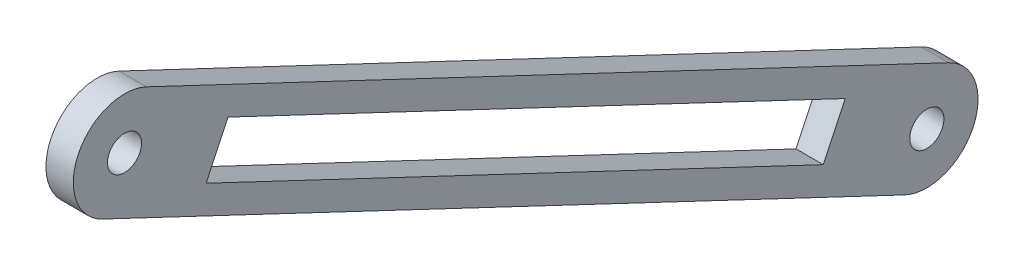
ISO-10303-21;
HEADER;
FILE_DESCRIPTION(('STEP AP214'),'2;1');
FILE_NAME('part.step','',(''),(''),'','','');
FILE_SCHEMA(('AUTOMOTIVE_DESIGN { 1 0 10303 214 1 1 1 1 }'));
ENDSEC;
DATA;
#1=APPLICATION_CONTEXT('core data for automotive mechanical design processes');
#2=APPLICATION_PROTOCOL_DEFINITION('international standard','automotive_design',2000,#1);
#3=PRODUCT_CONTEXT('',#1,'mechanical');
#4=PRODUCT('Part','Part','',(#3));
#5=PRODUCT_RELATED_PRODUCT_CATEGORY('part','',(#4));
#6=PRODUCT_DEFINITION_FORMATION('','',#4);
#7=PRODUCT_DEFINITION_CONTEXT('part definition',#1,'design');
#8=PRODUCT_DEFINITION('design','',#6,#7);
#9=PRODUCT_DEFINITION_SHAPE('','',#8);
#10=(LENGTH_UNIT() NAMED_UNIT(*) SI_UNIT(.MILLI.,.METRE.));
#11=(NAMED_UNIT(*) PLANE_ANGLE_UNIT() SI_UNIT($,.RADIAN.));
#12=(NAMED_UNIT(*) SI_UNIT($,.STERADIAN.) SOLID_ANGLE_UNIT());
#13=UNCERTAINTY_MEASURE_WITH_UNIT(LENGTH_MEASURE(1.E-05),#10,'distance_accuracy_value','');
#14=(GEOMETRIC_REPRESENTATION_CONTEXT(3) GLOBAL_UNCERTAINTY_ASSIGNED_CONTEXT((#13)) GLOBAL_UNIT_ASSIGNED_CONTEXT((#10,
#11,#12)) REPRESENTATION_CONTEXT('',''));
#15=CARTESIAN_POINT('',(0.,0.,0.));
#16=DIRECTION('',(0.,0.,1.));
#17=DIRECTION('',(1.,0.,0.));
#18=AXIS2_PLACEMENT_3D('',#15,#16,#17);
#19=CARTESIAN_POINT('',(57.,320.133867520905,-124.521978991094));
#20=DIRECTION('',(1.,0.,0.));
#21=DIRECTION('',(0.,0.,-1.));
#22=AXIS2_PLACEMENT_3D('',#19,#20,#21);
#23=CYLINDRICAL_SURFACE('',#22,11.25);
#24=CARTESIAN_POINT('',(63.,320.133867520905,-124.521978991094));
#25=DIRECTION('',(1.,0.,0.));
#26=DIRECTION('',(0.,0.,-1.));
#27=AXIS2_PLACEMENT_3D('',#24,#25,#26);
#28=CIRCLE('',#27,11.25);
#29=CARTESIAN_POINT('',(63.,330.29992469328,-129.340047231375));
#30=VERTEX_POINT('',#29);
#31=CARTESIAN_POINT('',(63.,309.96781034853,-119.703910750813));
#32=VERTEX_POINT('',#31);
#33=EDGE_CURVE('E141',#30,#32,#28,.T.);
#34=ORIENTED_EDGE('',*,*,#33,.F.);
#35=DIRECTION('',(1.,0.,0.));
#36=VECTOR('',#35,1.);
#37=CARTESIAN_POINT('',(57.,330.29992469328,-129.340047231375));
#38=LINE('',#37,#36);
#39=CARTESIAN_POINT('',(57.,330.29992469328,-129.340047231375));
#40=VERTEX_POINT('',#39);
#41=EDGE_CURVE('E11',#40,#30,#38,.T.);
#42=ORIENTED_EDGE('',*,*,#41,.F.);
#43=CARTESIAN_POINT('',(57.,320.133867520905,-124.521978991094));
#44=DIRECTION('',(1.,0.,0.));
#45=DIRECTION('',(0.,0.,-1.));
#46=AXIS2_PLACEMENT_3D('',#43,#44,#45);
#47=CIRCLE('',#46,11.25);
#48=CARTESIAN_POINT('',(57.,309.96781034853,-119.703910750813));
#49=VERTEX_POINT('',#48);
#50=EDGE_CURVE('E144',#40,#49,#47,.T.);
#51=ORIENTED_EDGE('',*,*,#50,.T.);
#52=DIRECTION('',(1.,0.,0.));
#53=VECTOR('',#52,1.);
#54=CARTESIAN_POINT('',(57.,309.96781034853,-119.703910750813));
#55=LINE('',#54,#53);
#56=EDGE_CURVE('E35',#49,#32,#55,.T.);
#57=ORIENTED_EDGE('',*,*,#56,.T.);
#58=EDGE_LOOP('',(#34,#42,#51,#57));
#59=FACE_BOUND('',#58,.T.);
#60=ADVANCED_FACE('F32',(#59),#23,.T.);
#61=CARTESIAN_POINT('',(57.,330.29992469328,-129.340047231375));
#62=DIRECTION('',(0.,0.903649526433319,-0.428272732469438));
#63=DIRECTION('',(0.,0.428272732469438,0.903649526433319));
#64=AXIS2_PLACEMENT_3D('',#61,#62,#63);
#65=PLANE('',#64);
#66=DIRECTION('',(0.,0.428272732469438,0.903649526433319));
#67=VECTOR('',#66,1.);
#68=CARTESIAN_POINT('',(63.,330.29992469328,-129.340047231375));
#69=LINE('',#68,#67);
#70=CARTESIAN_POINT('',(63.,246.786741861739,-305.551704885872));
#71=VERTEX_POINT('',#70);
#72=EDGE_CURVE('E148',#71,#30,#69,.T.);
#73=ORIENTED_EDGE('',*,*,#72,.F.);
#74=DIRECTION('',(1.,0.,0.));
#75=VECTOR('',#74,1.);
#76=CARTESIAN_POINT('',(57.,246.786741861739,-305.551704885872));
#77=LINE('',#76,#75);
#78=CARTESIAN_POINT('',(57.,246.786741861739,-305.551704885872));
#79=VERTEX_POINT('',#78);
#80=EDGE_CURVE('E40',#79,#71,#77,.T.);
#81=ORIENTED_EDGE('',*,*,#80,.F.);
#82=DIRECTION('',(0.,0.428272732469438,0.903649526433319));
#83=VECTOR('',#82,1.);
#84=CARTESIAN_POINT('',(57.,330.29992469328,-129.340047231375));
#85=LINE('',#84,#83);
#86=EDGE_CURVE('E154',#79,#40,#85,.T.);
#87=ORIENTED_EDGE('',*,*,#86,.T.);
#88=ORIENTED_EDGE('',*,*,#41,.T.);
#89=EDGE_LOOP('',(#73,#81,#87,#88));
#90=FACE_BOUND('',#89,.T.);
#91=ADVANCED_FACE('F180',(#90),#65,.T.);
#92=CARTESIAN_POINT('',(57.,236.620684689364,-300.733636645591));
#93=DIRECTION('',(1.,0.,0.));
#94=DIRECTION('',(0.,0.,-1.));
#95=AXIS2_PLACEMENT_3D('',#92,#93,#94);
#96=CYLINDRICAL_SURFACE('',#95,11.25);
#97=CARTESIAN_POINT('',(63.,236.620684689364,-300.733636645591));
#98=DIRECTION('',(1.,0.,0.));
#99=DIRECTION('',(0.,0.,-1.));
#100=AXIS2_PLACEMENT_3D('',#97,#98,#99);
#101=CIRCLE('',#100,11.25);
#102=CARTESIAN_POINT('',(63.,226.45462751699,-295.91556840531));
#103=VERTEX_POINT('',#102);
#104=EDGE_CURVE('E162',#103,#71,#101,.T.);
#105=ORIENTED_EDGE('',*,*,#104,.F.);
#106=DIRECTION('',(1.,0.,0.));
#107=VECTOR('',#106,1.);
#108=CARTESIAN_POINT('',(57.,226.45462751699,-295.91556840531));
#109=LINE('',#108,#107);
#110=CARTESIAN_POINT('',(57.,226.45462751699,-295.91556840531));
#111=VERTEX_POINT('',#110);
#112=EDGE_CURVE('E167',#111,#103,#109,.T.);
#113=ORIENTED_EDGE('',*,*,#112,.F.);
#114=CARTESIAN_POINT('',(57.,236.620684689364,-300.733636645591));
#115=DIRECTION('',(1.,0.,0.));
#116=DIRECTION('',(0.,0.,-1.));
#117=AXIS2_PLACEMENT_3D('',#114,#115,#116);
#118=CIRCLE('',#117,11.25);
#119=EDGE_CURVE('E151',#111,#79,#118,.T.);
#120=ORIENTED_EDGE('',*,*,#119,.T.);
#121=ORIENTED_EDGE('',*,*,#80,.T.);
#122=EDGE_LOOP('',(#105,#113,#120,#121));
#123=FACE_BOUND('',#122,.T.);
#124=ADVANCED_FACE('F185',(#123),#96,.T.);
#125=CARTESIAN_POINT('',(57.,309.96781034853,-119.703910750813));
#126=DIRECTION('',(0.,-0.903649526433319,0.428272732469438));
#127=DIRECTION('',(0.,-0.428272732469438,-0.903649526433319));
#128=AXIS2_PLACEMENT_3D('',#125,#126,#127);
#129=PLANE('',#128);
#130=DIRECTION('',(0.,-0.428272732469438,-0.903649526433319));
#131=VECTOR('',#130,1.);
#132=CARTESIAN_POINT('',(63.,309.96781034853,-119.703910750813));
#133=LINE('',#132,#131);
#134=EDGE_CURVE('E159',#32,#103,#133,.T.);
#135=ORIENTED_EDGE('',*,*,#134,.F.);
#136=ORIENTED_EDGE('',*,*,#56,.F.);
#137=DIRECTION('',(0.,-0.428272732469438,-0.903649526433319));
#138=VECTOR('',#137,1.);
#139=CARTESIAN_POINT('',(57.,309.96781034853,-119.703910750813));
#140=LINE('',#139,#138);
#141=EDGE_CURVE('E147',#49,#111,#140,.T.);
#142=ORIENTED_EDGE('',*,*,#141,.T.);
#143=ORIENTED_EDGE('',*,*,#112,.T.);
#144=EDGE_LOOP('',(#135,#136,#142,#143));
#145=FACE_BOUND('',#144,.T.);
#146=ADVANCED_FACE('F175',(#145),#129,.T.);
#147=CARTESIAN_POINT('',(57.,320.133867520905,-124.521978991094));
#148=DIRECTION('',(1.,0.,0.));
#149=DIRECTION('',(0.,0.,-1.));
#150=AXIS2_PLACEMENT_3D('',#147,#148,#149);
#151=PLANE('',#150);
#152=CARTESIAN_POINT('',(57.,236.620684689364,-300.733636645591));
#153=DIRECTION('',(1.,0.,0.));
#154=DIRECTION('',(0.,0.,-1.));
#155=AXIS2_PLACEMENT_3D('',#152,#153,#154);
#156=CIRCLE('',#155,3.75);
#157=CARTESIAN_POINT('',(57.,236.620684689364,-304.483636645591));
#158=VERTEX_POINT('',#157);
#159=EDGE_CURVE('E128',#158,#158,#156,.T.);
#160=ORIENTED_EDGE('',*,*,#159,.T.);
#161=EDGE_LOOP('',(#160));
#162=FACE_BOUND('',#161,.T.);
#163=DIRECTION('',(0.,0.428272732469438,0.90364952643332));
#164=VECTOR('',#163,1.);
#165=CARTESIAN_POINT('',(57.,251.339849756114,-282.810556420982));
#166=LINE('',#165,#164);
#167=CARTESIAN_POINT('',(57.,251.339849756114,-282.810556420982));
#168=VERTEX_POINT('',#167);
#169=CARTESIAN_POINT('',(57.,315.58075962653,-147.263127455984));
#170=VERTEX_POINT('',#169);
#171=EDGE_CURVE('E105',#168,#170,#166,.T.);
#172=ORIENTED_EDGE('',*,*,#171,.T.);
#173=DIRECTION('',(0.,-0.903649526433319,0.428272732469438));
#174=VECTOR('',#173,1.);
#175=CARTESIAN_POINT('',(57.,305.414702454155,-142.445059215703));
#176=LINE('',#175,#174);
#177=CARTESIAN_POINT('',(57.,305.414702454155,-142.445059215703));
#178=VERTEX_POINT('',#177);
#179=EDGE_CURVE('E99',#170,#178,#176,.T.);
#180=ORIENTED_EDGE('',*,*,#179,.T.);
#181=DIRECTION('',(0.,-0.428272732469438,-0.903649526433319));
#182=VECTOR('',#181,1.);
#183=CARTESIAN_POINT('',(57.,241.173792583739,-277.992488180701));
#184=LINE('',#183,#182);
#185=CARTESIAN_POINT('',(57.,241.173792583739,-277.992488180701));
#186=VERTEX_POINT('',#185);
#187=EDGE_CURVE('E108',#178,#186,#184,.T.);
#188=ORIENTED_EDGE('',*,*,#187,.T.);
#189=DIRECTION('',(0.,0.903649526433319,-0.428272732469438));
#190=VECTOR('',#189,1.);
#191=CARTESIAN_POINT('',(57.,241.173792583739,-277.992488180701));
#192=LINE('',#191,#190);
#193=EDGE_CURVE('E48',#186,#168,#192,.T.);
#194=ORIENTED_EDGE('',*,*,#193,.T.);
#195=EDGE_LOOP('',(#172,#180,#188,#194));
#196=FACE_BOUND('',#195,.T.);
#197=CARTESIAN_POINT('',(57.,320.133867520905,-124.521978991094));
#198=DIRECTION('',(1.,0.,0.));
#199=DIRECTION('',(0.,0.,-1.));
#200=AXIS2_PLACEMENT_3D('',#197,#198,#199);
#201=CIRCLE('',#200,3.75);
#202=CARTESIAN_POINT('',(57.,320.133867520905,-128.271978991094));
#203=VERTEX_POINT('',#202);
#204=EDGE_CURVE('E138',#203,#203,#201,.T.);
#205=ORIENTED_EDGE('',*,*,#204,.T.);
#206=EDGE_LOOP('',(#205));
#207=FACE_BOUND('',#206,.T.);
#208=ORIENTED_EDGE('',*,*,#50,.F.);
#209=ORIENTED_EDGE('',*,*,#86,.F.);
#210=ORIENTED_EDGE('',*,*,#119,.F.);
#211=ORIENTED_EDGE('',*,*,#141,.F.);
#212=EDGE_LOOP('',(#208,#209,#210,#211));
#213=FACE_BOUND('',#212,.T.);
#214=ADVANCED_FACE('F112',(#162,#196,#207,#213),#151,.F.);
#215=CARTESIAN_POINT('',(63.,320.133867520905,-124.521978991094));
#216=DIRECTION('',(1.,0.,0.));
#217=DIRECTION('',(0.,0.,-1.));
#218=AXIS2_PLACEMENT_3D('',#215,#216,#217);
#219=PLANE('',#218);
#220=CARTESIAN_POINT('',(63.,236.620684689364,-300.733636645591));
#221=DIRECTION('',(1.,0.,0.));
#222=DIRECTION('',(0.,0.,-1.));
#223=AXIS2_PLACEMENT_3D('',#220,#221,#222);
#224=CIRCLE('',#223,3.75);
#225=CARTESIAN_POINT('',(63.,236.620684689364,-304.483636645591));
#226=VERTEX_POINT('',#225);
#227=EDGE_CURVE('E121',#226,#226,#224,.T.);
#228=ORIENTED_EDGE('',*,*,#227,.F.);
#229=EDGE_LOOP('',(#228));
#230=FACE_BOUND('',#229,.T.);
#231=DIRECTION('',(0.,-0.903649526433319,0.428272732469438));
#232=VECTOR('',#231,1.);
#233=CARTESIAN_POINT('',(63.,305.414702454155,-142.445059215703));
#234=LINE('',#233,#232);
#235=CARTESIAN_POINT('',(63.,315.58075962653,-147.263127455984));
#236=VERTEX_POINT('',#235);
#237=CARTESIAN_POINT('',(63.,305.414702454155,-142.445059215703));
#238=VERTEX_POINT('',#237);
#239=EDGE_CURVE('E56',#236,#238,#234,.T.);
#240=ORIENTED_EDGE('',*,*,#239,.F.);
#241=DIRECTION('',(0.,0.428272732469438,0.90364952643332));
#242=VECTOR('',#241,1.);
#243=CARTESIAN_POINT('',(63.,251.339849756114,-282.810556420982));
#244=LINE('',#243,#242);
#245=CARTESIAN_POINT('',(63.,251.339849756114,-282.810556420982));
#246=VERTEX_POINT('',#245);
#247=EDGE_CURVE('E115',#246,#236,#244,.T.);
#248=ORIENTED_EDGE('',*,*,#247,.F.);
#249=DIRECTION('',(0.,0.903649526433319,-0.428272732469438));
#250=VECTOR('',#249,1.);
#251=CARTESIAN_POINT('',(63.,241.173792583739,-277.992488180701));
#252=LINE('',#251,#250);
#253=CARTESIAN_POINT('',(63.,241.173792583739,-277.992488180701));
#254=VERTEX_POINT('',#253);
#255=EDGE_CURVE('E118',#254,#246,#252,.T.);
#256=ORIENTED_EDGE('',*,*,#255,.F.);
#257=DIRECTION('',(0.,-0.428272732469438,-0.903649526433319));
#258=VECTOR('',#257,1.);
#259=CARTESIAN_POINT('',(63.,241.173792583739,-277.992488180701));
#260=LINE('',#259,#258);
#261=EDGE_CURVE('E127',#238,#254,#260,.T.);
#262=ORIENTED_EDGE('',*,*,#261,.F.);
#263=EDGE_LOOP('',(#240,#248,#256,#262));
#264=FACE_BOUND('',#263,.T.);
#265=CARTESIAN_POINT('',(63.,320.133867520905,-124.521978991094));
#266=DIRECTION('',(1.,0.,0.));
#267=DIRECTION('',(0.,0.,-1.));
#268=AXIS2_PLACEMENT_3D('',#265,#266,#267);
#269=CIRCLE('',#268,3.75);
#270=CARTESIAN_POINT('',(63.,320.133867520905,-128.271978991094));
#271=VERTEX_POINT('',#270);
#272=EDGE_CURVE('E134',#271,#271,#269,.T.);
#273=ORIENTED_EDGE('',*,*,#272,.F.);
#274=EDGE_LOOP('',(#273));
#275=FACE_BOUND('',#274,.T.);
#276=ORIENTED_EDGE('',*,*,#33,.T.);
#277=ORIENTED_EDGE('',*,*,#134,.T.);
#278=ORIENTED_EDGE('',*,*,#104,.T.);
#279=ORIENTED_EDGE('',*,*,#72,.T.);
#280=EDGE_LOOP('',(#276,#277,#278,#279));
#281=FACE_BOUND('',#280,.T.);
#282=ADVANCED_FACE('F177',(#230,#264,#275,#281),#219,.T.);
#283=CARTESIAN_POINT('',(57.,320.133867520905,-124.521978991094));
#284=DIRECTION('',(1.,0.,0.));
#285=DIRECTION('',(0.,0.,-1.));
#286=AXIS2_PLACEMENT_3D('',#283,#284,#285);
#287=CYLINDRICAL_SURFACE('',#286,3.75);
#288=ORIENTED_EDGE('',*,*,#204,.F.);
#289=EDGE_LOOP('',(#288));
#290=FACE_BOUND('',#289,.T.);
#291=ORIENTED_EDGE('',*,*,#272,.T.);
#292=EDGE_LOOP('',(#291));
#293=FACE_BOUND('',#292,.T.);
#294=ADVANCED_FACE('F219',(#290,#293),#287,.F.);
#295=CARTESIAN_POINT('',(57.,305.414702454155,-142.445059215703));
#296=DIRECTION('',(0.,0.428272732469438,0.903649526433319));
#297=DIRECTION('',(0.,-0.903649526433319,0.428272732469438));
#298=AXIS2_PLACEMENT_3D('',#295,#296,#297);
#299=PLANE('',#298);
#300=ORIENTED_EDGE('',*,*,#239,.T.);
#301=DIRECTION('',(1.,0.,0.));
#302=VECTOR('',#301,1.);
#303=CARTESIAN_POINT('',(57.,305.414702454155,-142.445059215703));
#304=LINE('',#303,#302);
#305=EDGE_CURVE('E95',#178,#238,#304,.T.);
#306=ORIENTED_EDGE('',*,*,#305,.F.);
#307=ORIENTED_EDGE('',*,*,#179,.F.);
#308=DIRECTION('',(1.,0.,0.));
#309=VECTOR('',#308,1.);
#310=CARTESIAN_POINT('',(57.,315.58075962653,-147.263127455984));
#311=LINE('',#310,#309);
#312=EDGE_CURVE('E132',#170,#236,#311,.T.);
#313=ORIENTED_EDGE('',*,*,#312,.T.);
#314=EDGE_LOOP('',(#300,#306,#307,#313));
#315=FACE_BOUND('',#314,.T.);
#316=ADVANCED_FACE('F97',(#315),#299,.F.);
#317=CARTESIAN_POINT('',(57.,251.339849756114,-282.810556420982));
#318=DIRECTION('',(0.,0.903649526433319,-0.428272732469438));
#319=DIRECTION('',(0.,0.428272732469438,0.903649526433319));
#320=AXIS2_PLACEMENT_3D('',#317,#318,#319);
#321=PLANE('',#320);
#322=ORIENTED_EDGE('',*,*,#247,.T.);
#323=ORIENTED_EDGE('',*,*,#312,.F.);
#324=ORIENTED_EDGE('',*,*,#171,.F.);
#325=DIRECTION('',(1.,0.,0.));
#326=VECTOR('',#325,1.);
#327=CARTESIAN_POINT('',(57.,251.339849756114,-282.810556420982));
#328=LINE('',#327,#326);
#329=EDGE_CURVE('E135',#168,#246,#328,.T.);
#330=ORIENTED_EDGE('',*,*,#329,.T.);
#331=EDGE_LOOP('',(#322,#323,#324,#330));
#332=FACE_BOUND('',#331,.T.);
#333=ADVANCED_FACE('F234',(#332),#321,.F.);
#334=CARTESIAN_POINT('',(57.,241.173792583739,-277.992488180701));
#335=DIRECTION('',(0.,-0.428272732469438,-0.903649526433319));
#336=DIRECTION('',(0.,0.903649526433319,-0.428272732469438));
#337=AXIS2_PLACEMENT_3D('',#334,#335,#336);
#338=PLANE('',#337);
#339=ORIENTED_EDGE('',*,*,#255,.T.);
#340=ORIENTED_EDGE('',*,*,#329,.F.);
#341=ORIENTED_EDGE('',*,*,#193,.F.);
#342=DIRECTION('',(1.,0.,0.));
#343=VECTOR('',#342,1.);
#344=CARTESIAN_POINT('',(57.,241.173792583739,-277.992488180701));
#345=LINE('',#344,#343);
#346=EDGE_CURVE('E104',#186,#254,#345,.T.);
#347=ORIENTED_EDGE('',*,*,#346,.T.);
#348=EDGE_LOOP('',(#339,#340,#341,#347));
#349=FACE_BOUND('',#348,.T.);
#350=ADVANCED_FACE('F241',(#349),#338,.F.);
#351=CARTESIAN_POINT('',(57.,241.173792583739,-277.992488180701));
#352=DIRECTION('',(0.,-0.903649526433319,0.428272732469438));
#353=DIRECTION('',(0.,-0.428272732469438,-0.903649526433319));
#354=AXIS2_PLACEMENT_3D('',#351,#352,#353);
#355=PLANE('',#354);
#356=ORIENTED_EDGE('',*,*,#261,.T.);
#357=ORIENTED_EDGE('',*,*,#346,.F.);
#358=ORIENTED_EDGE('',*,*,#187,.F.);
#359=ORIENTED_EDGE('',*,*,#305,.T.);
#360=EDGE_LOOP('',(#356,#357,#358,#359));
#361=FACE_BOUND('',#360,.T.);
#362=ADVANCED_FACE('F109',(#361),#355,.F.);
#363=CARTESIAN_POINT('',(57.,236.620684689364,-300.733636645591));
#364=DIRECTION('',(1.,0.,0.));
#365=DIRECTION('',(0.,0.,-1.));
#366=AXIS2_PLACEMENT_3D('',#363,#364,#365);
#367=CYLINDRICAL_SURFACE('',#366,3.75);
#368=ORIENTED_EDGE('',*,*,#159,.F.);
#369=EDGE_LOOP('',(#368));
#370=FACE_BOUND('',#369,.T.);
#371=ORIENTED_EDGE('',*,*,#227,.T.);
#372=EDGE_LOOP('',(#371));
#373=FACE_BOUND('',#372,.T.);
#374=ADVANCED_FACE('F255',(#370,#373),#367,.F.);
#375=CLOSED_SHELL('',(#60,#91,#124,#146,#214,#282,#294,#316,#333,#350,#362,#374));
#376=MANIFOLD_SOLID_BREP('B2',#375);
#377=ADVANCED_BREP_SHAPE_REPRESENTATION('',(#18,#376),#14);
#378=SHAPE_DEFINITION_REPRESENTATION(#9,#377);
ENDSEC;
END-ISO-10303-21;
